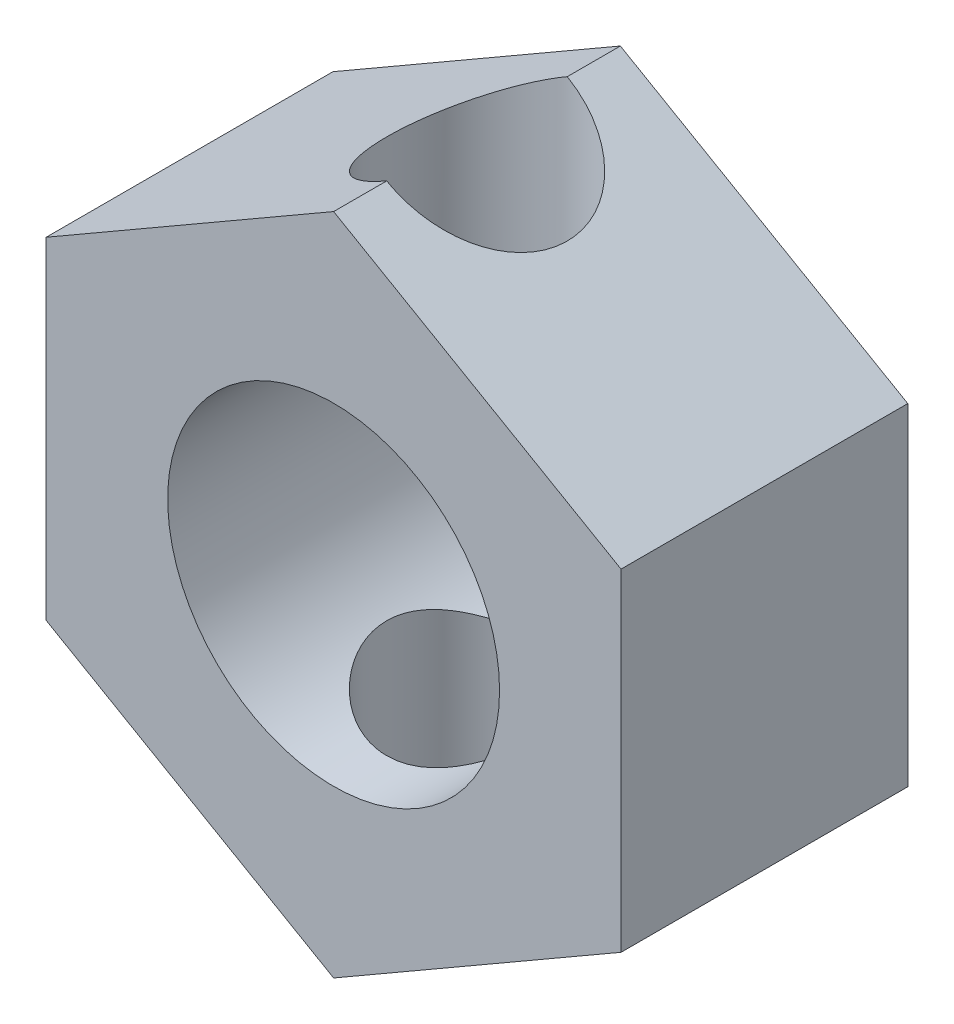
ISO-10303-21;
HEADER;
FILE_DESCRIPTION(('STEP AP214'),'2;1');
FILE_NAME('part.step','',(''),(''),'','','');
FILE_SCHEMA(('AUTOMOTIVE_DESIGN { 1 0 10303 214 1 1 1 1 }'));
ENDSEC;
DATA;
#1=APPLICATION_CONTEXT('core data for automotive mechanical design processes');
#2=APPLICATION_PROTOCOL_DEFINITION('international standard','automotive_design',2000,#1);
#3=PRODUCT_CONTEXT('',#1,'mechanical');
#4=PRODUCT('Part','Part','',(#3));
#5=PRODUCT_RELATED_PRODUCT_CATEGORY('part','',(#4));
#6=PRODUCT_DEFINITION_FORMATION('','',#4);
#7=PRODUCT_DEFINITION_CONTEXT('part definition',#1,'design');
#8=PRODUCT_DEFINITION('design','',#6,#7);
#9=PRODUCT_DEFINITION_SHAPE('','',#8);
#10=(LENGTH_UNIT() NAMED_UNIT(*) SI_UNIT(.MILLI.,.METRE.));
#11=(NAMED_UNIT(*) PLANE_ANGLE_UNIT() SI_UNIT($,.RADIAN.));
#12=(NAMED_UNIT(*) SI_UNIT($,.STERADIAN.) SOLID_ANGLE_UNIT());
#13=UNCERTAINTY_MEASURE_WITH_UNIT(LENGTH_MEASURE(1.E-05),#10,'distance_accuracy_value','');
#14=(GEOMETRIC_REPRESENTATION_CONTEXT(3) GLOBAL_UNCERTAINTY_ASSIGNED_CONTEXT((#13)) GLOBAL_UNIT_ASSIGNED_CONTEXT((#10,
#11,#12)) REPRESENTATION_CONTEXT('',''));
#15=CARTESIAN_POINT('',(0.,0.,0.));
#16=DIRECTION('',(0.,0.,1.));
#17=DIRECTION('',(1.,0.,0.));
#18=AXIS2_PLACEMENT_3D('',#15,#16,#17);
#19=CARTESIAN_POINT('',(0.,6.34981373060133,5.4864));
#20=DIRECTION('',(0.,0.,-1.));
#21=DIRECTION('',(-1.,0.,0.));
#22=AXIS2_PLACEMENT_3D('',#19,#20,#21);
#23=PLANE('',#22);
#24=DIRECTION('',(-0.866025403784438,0.500000000000001,0.));
#25=VECTOR('',#24,1.);
#26=CARTESIAN_POINT('',(0.,6.34981373060133,5.4864));
#27=LINE('',#26,#25);
#28=CARTESIAN_POINT('',(5.4991,3.17490686530066,5.4864));
#29=VERTEX_POINT('',#28);
#30=CARTESIAN_POINT('',(0.,6.34981373060133,5.4864));
#31=VERTEX_POINT('',#30);
#32=EDGE_CURVE('E510',#29,#31,#27,.T.);
#33=ORIENTED_EDGE('',*,*,#32,.T.);
#34=DIRECTION('',(-0.866025403784438,-0.500000000000001,0.));
#35=VECTOR('',#34,1.);
#36=CARTESIAN_POINT('',(0.,6.34981373060133,5.4864));
#37=LINE('',#36,#35);
#38=CARTESIAN_POINT('',(-5.4991,3.17490686530065,5.4864));
#39=VERTEX_POINT('',#38);
#40=EDGE_CURVE('E507',#31,#39,#37,.T.);
#41=ORIENTED_EDGE('',*,*,#40,.T.);
#42=DIRECTION('',(0.,-1.,0.));
#43=VECTOR('',#42,1.);
#44=CARTESIAN_POINT('',(-5.4991,3.17490686530065,5.4864));
#45=LINE('',#44,#43);
#46=CARTESIAN_POINT('',(-5.4991,-3.17490686530065,5.4864));
#47=VERTEX_POINT('',#46);
#48=EDGE_CURVE('E535',#39,#47,#45,.T.);
#49=ORIENTED_EDGE('',*,*,#48,.T.);
#50=DIRECTION('',(0.866025403784438,-0.500000000000001,0.));
#51=VECTOR('',#50,1.);
#52=CARTESIAN_POINT('',(-5.4991,-3.17490686530065,5.4864));
#53=LINE('',#52,#51);
#54=CARTESIAN_POINT('',(0.,-6.34981373060133,5.4864));
#55=VERTEX_POINT('',#54);
#56=EDGE_CURVE('E537',#47,#55,#53,.T.);
#57=ORIENTED_EDGE('',*,*,#56,.T.);
#58=DIRECTION('',(0.866025403784438,0.500000000000001,0.));
#59=VECTOR('',#58,1.);
#60=CARTESIAN_POINT('',(0.,-6.34981373060133,5.4864));
#61=LINE('',#60,#59);
#62=CARTESIAN_POINT('',(5.4991,-3.17490686530066,5.4864));
#63=VERTEX_POINT('',#62);
#64=EDGE_CURVE('E446',#55,#63,#61,.T.);
#65=ORIENTED_EDGE('',*,*,#64,.T.);
#66=DIRECTION('',(0.,1.,0.));
#67=VECTOR('',#66,1.);
#68=CARTESIAN_POINT('',(5.4991,3.17490686530066,5.4864));
#69=LINE('',#68,#67);
#70=EDGE_CURVE('E540',#63,#29,#69,.T.);
#71=ORIENTED_EDGE('',*,*,#70,.T.);
#72=EDGE_LOOP('',(#33,#41,#49,#57,#65,#71));
#73=FACE_BOUND('',#72,.T.);
#74=CARTESIAN_POINT('',(0.,0.,5.4864));
#75=DIRECTION('',(0.,0.,1.));
#76=DIRECTION('',(1.,0.,0.));
#77=AXIS2_PLACEMENT_3D('',#74,#75,#76);
#78=CIRCLE('',#77,3.175);
#79=CARTESIAN_POINT('',(3.175,0.,5.4864));
#80=VERTEX_POINT('',#79);
#81=EDGE_CURVE('E515',#80,#80,#78,.T.);
#82=ORIENTED_EDGE('',*,*,#81,.F.);
#83=EDGE_LOOP('',(#82));
#84=FACE_BOUND('',#83,.T.);
#85=ADVANCED_FACE('F360',(#73,#84),#23,.F.);
#86=CARTESIAN_POINT('',(0.,6.34981373060133,0.));
#87=DIRECTION('',(0.,0.,-1.));
#88=DIRECTION('',(-1.,0.,0.));
#89=AXIS2_PLACEMENT_3D('',#86,#87,#88);
#90=PLANE('',#89);
#91=DIRECTION('',(-0.866025403784438,0.500000000000001,0.));
#92=VECTOR('',#91,1.);
#93=CARTESIAN_POINT('',(0.,6.34981373060133,0.));
#94=LINE('',#93,#92);
#95=CARTESIAN_POINT('',(5.4991,3.17490686530066,0.));
#96=VERTEX_POINT('',#95);
#97=CARTESIAN_POINT('',(0.,6.34981373060133,0.));
#98=VERTEX_POINT('',#97);
#99=EDGE_CURVE('E521',#96,#98,#94,.T.);
#100=ORIENTED_EDGE('',*,*,#99,.F.);
#101=DIRECTION('',(0.,1.,0.));
#102=VECTOR('',#101,1.);
#103=CARTESIAN_POINT('',(5.4991,3.17490686530066,0.));
#104=LINE('',#103,#102);
#105=CARTESIAN_POINT('',(5.4991,-3.17490686530066,0.));
#106=VERTEX_POINT('',#105);
#107=EDGE_CURVE('E531',#106,#96,#104,.T.);
#108=ORIENTED_EDGE('',*,*,#107,.F.);
#109=DIRECTION('',(0.866025403784438,0.500000000000001,0.));
#110=VECTOR('',#109,1.);
#111=CARTESIAN_POINT('',(0.,-6.34981373060133,0.));
#112=LINE('',#111,#110);
#113=CARTESIAN_POINT('',(0.,-6.34981373060133,0.));
#114=VERTEX_POINT('',#113);
#115=EDGE_CURVE('E529',#114,#106,#112,.T.);
#116=ORIENTED_EDGE('',*,*,#115,.F.);
#117=DIRECTION('',(0.866025403784438,-0.500000000000001,0.));
#118=VECTOR('',#117,1.);
#119=CARTESIAN_POINT('',(-5.4991,-3.17490686530065,0.));
#120=LINE('',#119,#118);
#121=CARTESIAN_POINT('',(-5.4991,-3.17490686530065,0.));
#122=VERTEX_POINT('',#121);
#123=EDGE_CURVE('E527',#122,#114,#120,.T.);
#124=ORIENTED_EDGE('',*,*,#123,.F.);
#125=DIRECTION('',(0.,-1.,0.));
#126=VECTOR('',#125,1.);
#127=CARTESIAN_POINT('',(-5.4991,3.17490686530065,0.));
#128=LINE('',#127,#126);
#129=CARTESIAN_POINT('',(-5.4991,3.17490686530065,0.));
#130=VERTEX_POINT('',#129);
#131=EDGE_CURVE('E525',#130,#122,#128,.T.);
#132=ORIENTED_EDGE('',*,*,#131,.F.);
#133=DIRECTION('',(-0.866025403784438,-0.500000000000001,0.));
#134=VECTOR('',#133,1.);
#135=CARTESIAN_POINT('',(0.,6.34981373060133,0.));
#136=LINE('',#135,#134);
#137=EDGE_CURVE('E523',#98,#130,#136,.T.);
#138=ORIENTED_EDGE('',*,*,#137,.F.);
#139=EDGE_LOOP('',(#100,#108,#116,#124,#132,#138));
#140=FACE_BOUND('',#139,.T.);
#141=CARTESIAN_POINT('',(0.,0.,0.));
#142=DIRECTION('',(0.,0.,1.));
#143=DIRECTION('',(1.,0.,0.));
#144=AXIS2_PLACEMENT_3D('',#141,#142,#143);
#145=CIRCLE('',#144,3.175);
#146=CARTESIAN_POINT('',(3.175,0.,0.));
#147=VERTEX_POINT('',#146);
#148=EDGE_CURVE('E512',#147,#147,#145,.T.);
#149=ORIENTED_EDGE('',*,*,#148,.T.);
#150=EDGE_LOOP('',(#149));
#151=FACE_BOUND('',#150,.T.);
#152=ADVANCED_FACE('F477',(#140,#151),#90,.T.);
#153=CARTESIAN_POINT('',(0.,6.34981373060133,5.4864));
#154=DIRECTION('',(-0.500000000000001,-0.866025403784438,0.));
#155=DIRECTION('',(0.866025403784438,-0.500000000000001,0.));
#156=AXIS2_PLACEMENT_3D('',#153,#154,#155);
#157=PLANE('',#156);
#158=DIRECTION('',(0.,0.,-1.));
#159=VECTOR('',#158,1.);
#160=CARTESIAN_POINT('',(0.,6.34981373060133,5.4864));
#161=LINE('',#160,#159);
#162=CARTESIAN_POINT('',(0.,6.34981373060133,1.016));
#163=VERTEX_POINT('',#162);
#164=EDGE_CURVE('E373',#163,#98,#161,.T.);
#165=ORIENTED_EDGE('',*,*,#164,.F.);
#166=CARTESIAN_POINT('',(0.,6.34981373060133,2.7432));
#167=DIRECTION('',(-0.500000000000001,-0.866025403784438,0.));
#168=DIRECTION('',(-0.866025403784438,0.500000000000001,0.));
#169=AXIS2_PLACEMENT_3D('',#166,#167,#168);
#170=ELLIPSE('',#169,1.99439876988864,1.7272);
#171=CARTESIAN_POINT('',(0.,6.34981373060133,4.4704));
#172=VERTEX_POINT('',#171);
#173=EDGE_CURVE('E380',#163,#172,#170,.T.);
#174=ORIENTED_EDGE('',*,*,#173,.T.);
#175=EDGE_CURVE('E11',#31,#172,#161,.T.);
#176=ORIENTED_EDGE('',*,*,#175,.F.);
#177=ORIENTED_EDGE('',*,*,#32,.F.);
#178=DIRECTION('',(0.,0.,-1.));
#179=VECTOR('',#178,1.);
#180=CARTESIAN_POINT('',(5.4991,3.17490686530066,5.4864));
#181=LINE('',#180,#179);
#182=EDGE_CURVE('E541',#29,#96,#181,.T.);
#183=ORIENTED_EDGE('',*,*,#182,.T.);
#184=ORIENTED_EDGE('',*,*,#99,.T.);
#185=EDGE_LOOP('',(#165,#174,#176,#177,#183,#184));
#186=FACE_BOUND('',#185,.T.);
#187=ADVANCED_FACE('F362',(#186),#157,.F.);
#188=CARTESIAN_POINT('',(0.,6.34981373060133,5.4864));
#189=DIRECTION('',(0.500000000000001,-0.866025403784438,0.));
#190=DIRECTION('',(0.866025403784438,0.500000000000001,0.));
#191=AXIS2_PLACEMENT_3D('',#188,#189,#190);
#192=PLANE('',#191);
#193=ORIENTED_EDGE('',*,*,#175,.T.);
#194=CARTESIAN_POINT('',(0.,6.34981373060133,2.7432));
#195=DIRECTION('',(0.500000000000001,-0.866025403784438,0.));
#196=DIRECTION('',(0.866025403784438,0.500000000000001,0.));
#197=AXIS2_PLACEMENT_3D('',#194,#195,#196);
#198=ELLIPSE('',#197,1.99439876988865,1.7272);
#199=EDGE_CURVE('E442',#172,#163,#198,.T.);
#200=ORIENTED_EDGE('',*,*,#199,.T.);
#201=ORIENTED_EDGE('',*,*,#164,.T.);
#202=ORIENTED_EDGE('',*,*,#137,.T.);
#203=DIRECTION('',(0.,0.,-1.));
#204=VECTOR('',#203,1.);
#205=CARTESIAN_POINT('',(-5.4991,3.17490686530065,5.4864));
#206=LINE('',#205,#204);
#207=EDGE_CURVE('E450',#39,#130,#206,.T.);
#208=ORIENTED_EDGE('',*,*,#207,.F.);
#209=ORIENTED_EDGE('',*,*,#40,.F.);
#210=EDGE_LOOP('',(#193,#200,#201,#202,#208,#209));
#211=FACE_BOUND('',#210,.T.);
#212=ADVANCED_FACE('F496',(#211),#192,.F.);
#213=CARTESIAN_POINT('',(-5.4991,3.17490686530065,5.4864));
#214=DIRECTION('',(1.,0.,0.));
#215=DIRECTION('',(0.,0.,-1.));
#216=AXIS2_PLACEMENT_3D('',#213,#214,#215);
#217=PLANE('',#216);
#218=ORIENTED_EDGE('',*,*,#131,.T.);
#219=DIRECTION('',(0.,0.,-1.));
#220=VECTOR('',#219,1.);
#221=CARTESIAN_POINT('',(-5.4991,-3.17490686530065,5.4864));
#222=LINE('',#221,#220);
#223=EDGE_CURVE('E447',#47,#122,#222,.T.);
#224=ORIENTED_EDGE('',*,*,#223,.F.);
#225=ORIENTED_EDGE('',*,*,#48,.F.);
#226=ORIENTED_EDGE('',*,*,#207,.T.);
#227=EDGE_LOOP('',(#218,#224,#225,#226));
#228=FACE_BOUND('',#227,.T.);
#229=ADVANCED_FACE('F494',(#228),#217,.F.);
#230=CARTESIAN_POINT('',(-5.4991,-3.17490686530065,5.4864));
#231=DIRECTION('',(0.500000000000001,0.866025403784438,0.));
#232=DIRECTION('',(-0.866025403784438,0.500000000000001,0.));
#233=AXIS2_PLACEMENT_3D('',#230,#231,#232);
#234=PLANE('',#233);
#235=DIRECTION('',(0.,0.,-1.));
#236=VECTOR('',#235,1.);
#237=CARTESIAN_POINT('',(0.,-6.34981373060133,5.4864));
#238=LINE('',#237,#236);
#239=CARTESIAN_POINT('',(0.,-6.34981373060133,1.016));
#240=VERTEX_POINT('',#239);
#241=EDGE_CURVE('E441',#240,#114,#238,.T.);
#242=ORIENTED_EDGE('',*,*,#241,.F.);
#243=CARTESIAN_POINT('',(0.,-6.34981373060133,2.7432));
#244=DIRECTION('',(0.500000000000001,0.866025403784438,0.));
#245=DIRECTION('',(-0.866025403784438,0.500000000000001,0.));
#246=AXIS2_PLACEMENT_3D('',#243,#244,#245);
#247=ELLIPSE('',#246,1.99439876988865,1.7272);
#248=CARTESIAN_POINT('',(0.,-6.34981373060133,4.4704));
#249=VERTEX_POINT('',#248);
#250=EDGE_CURVE('E387',#240,#249,#247,.T.);
#251=ORIENTED_EDGE('',*,*,#250,.T.);
#252=EDGE_CURVE('E438',#55,#249,#238,.T.);
#253=ORIENTED_EDGE('',*,*,#252,.F.);
#254=ORIENTED_EDGE('',*,*,#56,.F.);
#255=ORIENTED_EDGE('',*,*,#223,.T.);
#256=ORIENTED_EDGE('',*,*,#123,.T.);
#257=EDGE_LOOP('',(#242,#251,#253,#254,#255,#256));
#258=FACE_BOUND('',#257,.T.);
#259=ADVANCED_FACE('F436',(#258),#234,.F.);
#260=CARTESIAN_POINT('',(0.,-6.34981373060133,5.4864));
#261=DIRECTION('',(-0.500000000000001,0.866025403784438,0.));
#262=DIRECTION('',(-0.866025403784438,-0.500000000000001,0.));
#263=AXIS2_PLACEMENT_3D('',#260,#261,#262);
#264=PLANE('',#263);
#265=ORIENTED_EDGE('',*,*,#252,.T.);
#266=CARTESIAN_POINT('',(0.,-6.34981373060133,2.7432));
#267=DIRECTION('',(-0.500000000000001,0.866025403784438,0.));
#268=DIRECTION('',(0.866025403784438,0.500000000000001,0.));
#269=AXIS2_PLACEMENT_3D('',#266,#267,#268);
#270=ELLIPSE('',#269,1.99439876988864,1.7272);
#271=EDGE_CURVE('E428',#249,#240,#270,.T.);
#272=ORIENTED_EDGE('',*,*,#271,.T.);
#273=ORIENTED_EDGE('',*,*,#241,.T.);
#274=ORIENTED_EDGE('',*,*,#115,.T.);
#275=DIRECTION('',(0.,0.,-1.));
#276=VECTOR('',#275,1.);
#277=CARTESIAN_POINT('',(5.4991,-3.17490686530066,5.4864));
#278=LINE('',#277,#276);
#279=EDGE_CURVE('E452',#63,#106,#278,.T.);
#280=ORIENTED_EDGE('',*,*,#279,.F.);
#281=ORIENTED_EDGE('',*,*,#64,.F.);
#282=EDGE_LOOP('',(#265,#272,#273,#274,#280,#281));
#283=FACE_BOUND('',#282,.T.);
#284=ADVANCED_FACE('F444',(#283),#264,.F.);
#285=CARTESIAN_POINT('',(5.4991,3.17490686530066,5.4864));
#286=DIRECTION('',(-1.,0.,0.));
#287=DIRECTION('',(0.,0.,1.));
#288=AXIS2_PLACEMENT_3D('',#285,#286,#287);
#289=PLANE('',#288);
#290=ORIENTED_EDGE('',*,*,#107,.T.);
#291=ORIENTED_EDGE('',*,*,#182,.F.);
#292=ORIENTED_EDGE('',*,*,#70,.F.);
#293=ORIENTED_EDGE('',*,*,#279,.T.);
#294=EDGE_LOOP('',(#290,#291,#292,#293));
#295=FACE_BOUND('',#294,.T.);
#296=ADVANCED_FACE('F474',(#295),#289,.F.);
#297=CARTESIAN_POINT('',(0.,0.,5.4864));
#298=DIRECTION('',(0.,0.,-1.));
#299=DIRECTION('',(-1.,0.,0.));
#300=AXIS2_PLACEMENT_3D('',#297,#298,#299);
#301=CYLINDRICAL_SURFACE('',#300,3.175);
#302=CARTESIAN_POINT('',(0.,-3.175,4.4704));
#303=CARTESIAN_POINT('',(0.0898167329870319,-3.17499484200097,4.47039426316033));
#304=CARTESIAN_POINT('',(0.179710396777628,-3.17114975925812,4.46335353824676));
#305=CARTESIAN_POINT('',(0.356779036000196,-3.15614659634562,4.43553214119056));
#306=CARTESIAN_POINT('',(0.443949931988856,-3.14497804708023,4.41473179892229));
#307=CARTESIAN_POINT('',(0.612755080544286,-3.11648141632095,4.36047558287019));
#308=CARTESIAN_POINT('',(0.694410411602408,-3.09917857401842,4.32707153065061));
#309=CARTESIAN_POINT('',(0.850799732084929,-3.05994681948074,4.24885998275857));
#310=CARTESIAN_POINT('',(0.925533518541815,-3.03801777164842,4.20405215282581));
#311=CARTESIAN_POINT('',(1.0716578715755,-2.98973072895781,4.10088302184072));
#312=CARTESIAN_POINT('',(1.14247785066843,-2.96317321502845,4.04180856025901));
#313=CARTESIAN_POINT('',(1.27374384775618,-2.90916641429737,3.91334660815034));
#314=CARTESIAN_POINT('',(1.33418038986057,-2.88171633982664,3.84394980409459));
#315=CARTESIAN_POINT('',(1.44881148181351,-2.82595304844433,3.68888927626324));
#316=CARTESIAN_POINT('',(1.5018524704536,-2.79780929477208,3.60230392840672));
#317=CARTESIAN_POINT('',(1.59241122402044,-2.7472815216645,3.41980814769005));
#318=CARTESIAN_POINT('',(1.62994117568031,-2.72489298571024,3.32390510902082));
#319=CARTESIAN_POINT('',(1.68576600124417,-2.69069454210209,3.13151974847052));
#320=CARTESIAN_POINT('',(1.70512359412162,-2.67830711291766,3.03545444315249));
#321=CARTESIAN_POINT('',(1.72721683304719,-2.66412109265389,2.84071296602228));
#322=CARTESIAN_POINT('',(1.72997524162547,-2.66230800104692,2.74204055605041));
#323=CARTESIAN_POINT('',(1.71956662107674,-2.66903051227905,2.56066642573841));
#324=CARTESIAN_POINT('',(1.7086960464526,-2.67607428080865,2.47776228487492));
#325=CARTESIAN_POINT('',(1.67539045912867,-2.69704944144968,2.31521296463369));
#326=CARTESIAN_POINT('',(1.65295041225415,-2.71098383173981,2.2355692202353));
#327=CARTESIAN_POINT('',(1.59682922869678,-2.74442012851359,2.07958562434921));
#328=CARTESIAN_POINT('',(1.56291239932,-2.76403741356199,2.00335650840409));
#329=CARTESIAN_POINT('',(1.48500048339766,-2.80666515066853,1.85728015534768));
#330=CARTESIAN_POINT('',(1.44100099769845,-2.82967708227558,1.78743572259403));
#331=CARTESIAN_POINT('',(1.33631133979448,-2.88076103596006,1.64480391669395));
#332=CARTESIAN_POINT('',(1.27409486773378,-2.90906693011305,1.57321637617155));
#333=CARTESIAN_POINT('',(1.13855614581348,-2.96474061704806,1.44093880325029));
#334=CARTESIAN_POINT('',(1.06522665805137,-2.99210778408684,1.38025592977166));
#335=CARTESIAN_POINT('',(0.903660215249716,-3.04494539658694,1.26776420536643));
#336=CARTESIAN_POINT('',(0.814767962766248,-3.07018080541161,1.21677662560585));
#337=CARTESIAN_POINT('',(0.627961499064385,-3.11375255101697,1.13092760937982));
#338=CARTESIAN_POINT('',(0.530055717587379,-3.13209525409142,1.09605128524923));
#339=CARTESIAN_POINT('',(0.337632448212788,-3.15835019333608,1.04668486278066));
#340=CARTESIAN_POINT('',(0.243631771803311,-3.16706671226616,1.03061455863196));
#341=CARTESIAN_POINT('',(0.0538862781183495,-3.17595961869238,1.01422149624866));
#342=CARTESIAN_POINT('',(-0.0418574275379516,-3.17614127075226,1.01388903043898));
#343=CARTESIAN_POINT('',(-0.222630300123887,-3.16835426762471,1.02823965118669));
#344=CARTESIAN_POINT('',(-0.307811973389664,-3.16115964711464,1.04149669083814));
#345=CARTESIAN_POINT('',(-0.474526421749048,-3.14046289285925,1.08025979224462));
#346=CARTESIAN_POINT('',(-0.556058823079064,-3.12696011463607,1.10576710556589));
#347=CARTESIAN_POINT('',(-0.715436921893435,-3.09443863657224,1.16875149841363));
#348=CARTESIAN_POINT('',(-0.793151670088338,-3.07529823396287,1.20649475616212));
#349=CARTESIAN_POINT('',(-0.941355668884583,-3.03321912282633,1.29253789832276));
#350=CARTESIAN_POINT('',(-1.01184219665667,-3.01027899141093,1.3408417395432));
#351=CARTESIAN_POINT('',(-1.15187925533852,-2.95971846730473,1.45273874061451));
#352=CARTESIAN_POINT('',(-1.22046654048612,-2.93186099072405,1.51743133330519));
#353=CARTESIAN_POINT('',(-1.34632605581709,-2.87624333035612,1.65716090069406));
#354=CARTESIAN_POINT('',(-1.40358695617026,-2.84848327100078,1.73220810708041));
#355=CARTESIAN_POINT('',(-1.50930406073951,-2.79399702964103,1.89731456803237));
#356=CARTESIAN_POINT('',(-1.55679695839788,-2.7674988325876,1.98807334753819));
#357=CARTESIAN_POINT('',(-1.63536975293384,-2.7218154792425,2.17811790282001));
#358=CARTESIAN_POINT('',(-1.66647342303255,-2.70261974175344,2.27739108354074));
#359=CARTESIAN_POINT('',(-1.70828382295167,-2.67636880112584,2.47144719011798));
#360=CARTESIAN_POINT('',(-1.72068332127368,-2.668312524142,2.56572446352123));
#361=CARTESIAN_POINT('',(-1.72975688521704,-2.66244374147667,2.75532206760347));
#362=CARTESIAN_POINT('',(-1.72644337296087,-2.66462314383421,2.85064151491499));
#363=CARTESIAN_POINT('',(-1.70582759803793,-2.67785061366613,3.02632479252249));
#364=CARTESIAN_POINT('',(-1.69041123113614,-2.6877017050996,3.10701438229931));
#365=CARTESIAN_POINT('',(-1.64867033738276,-2.71350503746821,3.26449218816027));
#366=CARTESIAN_POINT('',(-1.62234150227161,-2.72945968790626,3.34127884990558));
#367=CARTESIAN_POINT('',(-1.55774844297325,-2.76686018244403,3.49417018057132));
#368=CARTESIAN_POINT('',(-1.51884069270724,-2.78858706965437,3.56993178768551));
#369=CARTESIAN_POINT('',(-1.43081457938665,-2.83476013423946,3.71435951711862));
#370=CARTESIAN_POINT('',(-1.38169075459496,-2.85920776291876,3.78302181447284));
#371=CARTESIAN_POINT('',(-1.26590027631126,-2.91252000323831,3.92223033835789));
#372=CARTESIAN_POINT('',(-1.19770097359167,-2.94148987707649,3.99146849457056));
#373=CARTESIAN_POINT('',(-1.05011316478987,-2.99735105334147,4.11794712844454));
#374=CARTESIAN_POINT('',(-0.970716985738062,-3.02424091064674,4.17517931121356));
#375=CARTESIAN_POINT('',(-0.799648332324617,-3.07398126546603,4.27748011125118));
#376=CARTESIAN_POINT('',(-0.707672838408708,-3.09668166594536,4.32211931330015));
#377=CARTESIAN_POINT('',(-0.515991222207537,-3.13430112883055,4.39468714665707));
#378=CARTESIAN_POINT('',(-0.416306007716474,-3.14924044322134,4.4226592977591));
#379=CARTESIAN_POINT('',(-0.262876021187144,-3.16452941008055,4.45109225903149));
#380=CARTESIAN_POINT('',(-0.210650818113228,-3.16844092250735,4.45831759952544));
#381=CARTESIAN_POINT('',(-0.105625946387151,-3.17367773046768,4.46797314994273));
#382=CARTESIAN_POINT('',(-0.0528262794477243,-3.17500303370974,4.47040337415852));
#383=CARTESIAN_POINT('',(0.,-3.175,4.4704));
#384=B_SPLINE_CURVE_WITH_KNOTS('',3,(#302,#303,#304,#305,#306,#307,#308,#309,#310,#311,#312,
#313,#314,#315,#316,#317,#318,#319,#320,#321,#322,#323,#324,#325,#326,#327,#328,#329,#330,#331,
#332,#333,#334,#335,#336,#337,#338,#339,#340,#341,#342,#343,#344,#345,#346,#347,#348,#349,#350,
#351,#352,#353,#354,#355,#356,#357,#358,#359,#360,#361,#362,#363,#364,#365,#366,#367,#368,#369,
#370,#371,#372,#373,#374,#375,#376,#377,#378,#379,#380,#381,#382,#383),.UNSPECIFIED.,.T.,.F.,(4,
2,2,2,2,2,2,2,2,2,2,2,2,2,2,2,2,2,2,2,2,2,2,2,2,2,2,2,2,2,2,2,2,2,2,2,2,2,2,2,4),(0.,
0.269237366741943,0.538860457206649,0.807386833520669,1.07592108161609,1.36266948063225,
1.64967819109358,1.96419704531975,2.27846831600627,2.57294341145819,2.86701459980268,
3.11756500584304,3.36822452493014,3.62438021478773,3.88064788119479,4.17633401900357,
4.47221357134702,4.78711425412076,5.10172336681184,5.38739145348506,5.67288332913719,
5.93120440761279,6.18955188343689,6.45394594831553,6.7184392458725,7.01214559552773,
7.30614427141866,7.6218681846216,7.93713285826403,8.22166481147848,8.50597186181727,
8.75310154925956,9.00032889696823,9.26301971807991,9.52585134216132,9.82874467547091,
10.131846592656,10.4442934112149,10.7559207748693,10.9142749065924,11.0726285663201),.UNSPECIFIED.);
#385=CARTESIAN_POINT('',(0.,-3.175,4.4704));
#386=VERTEX_POINT('',#385);
#387=EDGE_CURVE('E364',#386,#386,#384,.T.);
#388=ORIENTED_EDGE('',*,*,#387,.F.);
#389=EDGE_LOOP('',(#388));
#390=FACE_BOUND('',#389,.T.);
#391=CARTESIAN_POINT('',(0.,3.175,4.4704));
#392=CARTESIAN_POINT('',(-0.0898167329870319,3.17499484200097,4.47039426316033));
#393=CARTESIAN_POINT('',(-0.179710396777628,3.17114975925812,4.46335353824676));
#394=CARTESIAN_POINT('',(-0.356779036000196,3.15614659634562,4.43553214119056));
#395=CARTESIAN_POINT('',(-0.443949931988856,3.14497804708023,4.41473179892229));
#396=CARTESIAN_POINT('',(-0.612755080544286,3.11648141632095,4.36047558287019));
#397=CARTESIAN_POINT('',(-0.694410411602408,3.09917857401842,4.32707153065061));
#398=CARTESIAN_POINT('',(-0.850799732084929,3.05994681948074,4.24885998275857));
#399=CARTESIAN_POINT('',(-0.925533518541815,3.03801777164842,4.20405215282581));
#400=CARTESIAN_POINT('',(-1.0716578715755,2.98973072895781,4.10088302184072));
#401=CARTESIAN_POINT('',(-1.14247785066843,2.96317321502845,4.04180856025901));
#402=CARTESIAN_POINT('',(-1.27374384775618,2.90916641429737,3.91334660815034));
#403=CARTESIAN_POINT('',(-1.33418038986057,2.88171633982664,3.84394980409459));
#404=CARTESIAN_POINT('',(-1.44881148181351,2.82595304844433,3.68888927626324));
#405=CARTESIAN_POINT('',(-1.5018524704536,2.79780929477208,3.60230392840672));
#406=CARTESIAN_POINT('',(-1.59241122402044,2.7472815216645,3.41980814769005));
#407=CARTESIAN_POINT('',(-1.62994117568031,2.72489298571024,3.32390510902082));
#408=CARTESIAN_POINT('',(-1.68576600124417,2.69069454210209,3.13151974847052));
#409=CARTESIAN_POINT('',(-1.70512359412162,2.67830711291766,3.03545444315249));
#410=CARTESIAN_POINT('',(-1.72721683304719,2.66412109265389,2.84071296602228));
#411=CARTESIAN_POINT('',(-1.72997524162547,2.66230800104692,2.74204055605041));
#412=CARTESIAN_POINT('',(-1.71956662107674,2.66903051227905,2.56066642573841));
#413=CARTESIAN_POINT('',(-1.7086960464526,2.67607428080865,2.47776228487492));
#414=CARTESIAN_POINT('',(-1.67539045912867,2.69704944144968,2.31521296463369));
#415=CARTESIAN_POINT('',(-1.65295041225415,2.71098383173981,2.2355692202353));
#416=CARTESIAN_POINT('',(-1.59682922869678,2.74442012851359,2.07958562434921));
#417=CARTESIAN_POINT('',(-1.56291239932,2.76403741356199,2.00335650840409));
#418=CARTESIAN_POINT('',(-1.48500048339766,2.80666515066853,1.85728015534768));
#419=CARTESIAN_POINT('',(-1.44100099769845,2.82967708227558,1.78743572259403));
#420=CARTESIAN_POINT('',(-1.33631133979448,2.88076103596006,1.64480391669395));
#421=CARTESIAN_POINT('',(-1.27409486773378,2.90906693011305,1.57321637617155));
#422=CARTESIAN_POINT('',(-1.13855614581348,2.96474061704806,1.44093880325029));
#423=CARTESIAN_POINT('',(-1.06522665805137,2.99210778408684,1.38025592977166));
#424=CARTESIAN_POINT('',(-0.903660215249716,3.04494539658694,1.26776420536643));
#425=CARTESIAN_POINT('',(-0.814767962766248,3.07018080541161,1.21677662560585));
#426=CARTESIAN_POINT('',(-0.627961499064385,3.11375255101697,1.13092760937982));
#427=CARTESIAN_POINT('',(-0.530055717587379,3.13209525409142,1.09605128524923));
#428=CARTESIAN_POINT('',(-0.337632448212788,3.15835019333608,1.04668486278066));
#429=CARTESIAN_POINT('',(-0.243631771803311,3.16706671226616,1.03061455863196));
#430=CARTESIAN_POINT('',(-0.0538862781183495,3.17595961869238,1.01422149624866));
#431=CARTESIAN_POINT('',(0.0418574275379516,3.17614127075226,1.01388903043898));
#432=CARTESIAN_POINT('',(0.222630300123887,3.16835426762471,1.02823965118669));
#433=CARTESIAN_POINT('',(0.307811973389664,3.16115964711464,1.04149669083814));
#434=CARTESIAN_POINT('',(0.474526421749048,3.14046289285925,1.08025979224462));
#435=CARTESIAN_POINT('',(0.556058823079064,3.12696011463607,1.10576710556589));
#436=CARTESIAN_POINT('',(0.715436921893435,3.09443863657224,1.16875149841363));
#437=CARTESIAN_POINT('',(0.793151670088338,3.07529823396287,1.20649475616212));
#438=CARTESIAN_POINT('',(0.941355668884583,3.03321912282633,1.29253789832276));
#439=CARTESIAN_POINT('',(1.01184219665667,3.01027899141093,1.3408417395432));
#440=CARTESIAN_POINT('',(1.15187925533852,2.95971846730473,1.45273874061451));
#441=CARTESIAN_POINT('',(1.22046654048612,2.93186099072405,1.51743133330519));
#442=CARTESIAN_POINT('',(1.34632605581709,2.87624333035612,1.65716090069406));
#443=CARTESIAN_POINT('',(1.40358695617026,2.84848327100078,1.73220810708041));
#444=CARTESIAN_POINT('',(1.50930406073951,2.79399702964103,1.89731456803237));
#445=CARTESIAN_POINT('',(1.55679695839788,2.7674988325876,1.98807334753819));
#446=CARTESIAN_POINT('',(1.63536975293384,2.7218154792425,2.17811790282001));
#447=CARTESIAN_POINT('',(1.66647342303255,2.70261974175344,2.27739108354074));
#448=CARTESIAN_POINT('',(1.70828382295167,2.67636880112584,2.47144719011798));
#449=CARTESIAN_POINT('',(1.72068332127368,2.668312524142,2.56572446352123));
#450=CARTESIAN_POINT('',(1.72975688521704,2.66244374147667,2.75532206760347));
#451=CARTESIAN_POINT('',(1.72644337296087,2.66462314383421,2.85064151491499));
#452=CARTESIAN_POINT('',(1.70582759803793,2.67785061366613,3.02632479252249));
#453=CARTESIAN_POINT('',(1.69041123113614,2.6877017050996,3.10701438229931));
#454=CARTESIAN_POINT('',(1.64867033738276,2.71350503746821,3.26449218816027));
#455=CARTESIAN_POINT('',(1.62234150227161,2.72945968790626,3.34127884990558));
#456=CARTESIAN_POINT('',(1.55774844297325,2.76686018244403,3.49417018057132));
#457=CARTESIAN_POINT('',(1.51884069270724,2.78858706965437,3.56993178768551));
#458=CARTESIAN_POINT('',(1.43081457938665,2.83476013423946,3.71435951711862));
#459=CARTESIAN_POINT('',(1.38169075459496,2.85920776291876,3.78302181447284));
#460=CARTESIAN_POINT('',(1.26590027631126,2.91252000323831,3.92223033835789));
#461=CARTESIAN_POINT('',(1.19770097359167,2.94148987707649,3.99146849457056));
#462=CARTESIAN_POINT('',(1.05011316478987,2.99735105334147,4.11794712844454));
#463=CARTESIAN_POINT('',(0.970716985738062,3.02424091064674,4.17517931121356));
#464=CARTESIAN_POINT('',(0.799648332324617,3.07398126546603,4.27748011125118));
#465=CARTESIAN_POINT('',(0.707672838408708,3.09668166594536,4.32211931330015));
#466=CARTESIAN_POINT('',(0.515991222207537,3.13430112883055,4.39468714665707));
#467=CARTESIAN_POINT('',(0.416306007716474,3.14924044322134,4.4226592977591));
#468=CARTESIAN_POINT('',(0.262876021187144,3.16452941008055,4.45109225903149));
#469=CARTESIAN_POINT('',(0.210650818113228,3.16844092250735,4.45831759952544));
#470=CARTESIAN_POINT('',(0.105625946387151,3.17367773046768,4.46797314994273));
#471=CARTESIAN_POINT('',(0.0528262794477243,3.17500303370974,4.47040337415852));
#472=CARTESIAN_POINT('',(0.,3.175,4.4704));
#473=B_SPLINE_CURVE_WITH_KNOTS('',3,(#391,#392,#393,#394,#395,#396,#397,#398,#399,#400,#401,
#402,#403,#404,#405,#406,#407,#408,#409,#410,#411,#412,#413,#414,#415,#416,#417,#418,#419,#420,
#421,#422,#423,#424,#425,#426,#427,#428,#429,#430,#431,#432,#433,#434,#435,#436,#437,#438,#439,
#440,#441,#442,#443,#444,#445,#446,#447,#448,#449,#450,#451,#452,#453,#454,#455,#456,#457,#458,
#459,#460,#461,#462,#463,#464,#465,#466,#467,#468,#469,#470,#471,#472),.UNSPECIFIED.,.T.,.F.,(4,
2,2,2,2,2,2,2,2,2,2,2,2,2,2,2,2,2,2,2,2,2,2,2,2,2,2,2,2,2,2,2,2,2,2,2,2,2,2,2,4),(0.,
0.269237366741943,0.538860457206649,0.807386833520669,1.07592108161609,1.36266948063225,
1.64967819109358,1.96419704531975,2.27846831600627,2.57294341145819,2.86701459980268,
3.11756500584304,3.36822452493014,3.62438021478773,3.88064788119479,4.17633401900357,
4.47221357134702,4.78711425412076,5.10172336681184,5.38739145348506,5.67288332913719,
5.93120440761279,6.18955188343689,6.45394594831553,6.7184392458725,7.01214559552773,
7.30614427141866,7.6218681846216,7.93713285826403,8.22166481147848,8.50597186181727,
8.75310154925956,9.00032889696823,9.26301971807991,9.52585134216132,9.82874467547091,
10.131846592656,10.4442934112149,10.7559207748693,10.9142749065924,11.0726285663201),.UNSPECIFIED.);
#474=CARTESIAN_POINT('',(0.,3.175,4.4704));
#475=VERTEX_POINT('',#474);
#476=EDGE_CURVE('E457',#475,#475,#473,.T.);
#477=ORIENTED_EDGE('',*,*,#476,.F.);
#478=EDGE_LOOP('',(#477));
#479=FACE_BOUND('',#478,.T.);
#480=ORIENTED_EDGE('',*,*,#81,.T.);
#481=EDGE_LOOP('',(#480));
#482=FACE_BOUND('',#481,.T.);
#483=ORIENTED_EDGE('',*,*,#148,.F.);
#484=EDGE_LOOP('',(#483));
#485=FACE_BOUND('',#484,.T.);
#486=ADVANCED_FACE('F461',(#390,#479,#482,#485),#301,.F.);
#487=CARTESIAN_POINT('',(0.,-6.34981373060133,2.7432));
#488=DIRECTION('',(0.,1.,0.));
#489=DIRECTION('',(0.,0.,1.));
#490=AXIS2_PLACEMENT_3D('',#487,#488,#489);
#491=CYLINDRICAL_SURFACE('',#490,1.7272);
#492=ORIENTED_EDGE('',*,*,#476,.T.);
#493=EDGE_LOOP('',(#492));
#494=FACE_BOUND('',#493,.T.);
#495=ORIENTED_EDGE('',*,*,#199,.F.);
#496=ORIENTED_EDGE('',*,*,#173,.F.);
#497=EDGE_LOOP('',(#495,#496));
#498=FACE_BOUND('',#497,.T.);
#499=ADVANCED_FACE('F464',(#494,#498),#491,.F.);
#500=ORIENTED_EDGE('',*,*,#387,.T.);
#501=EDGE_LOOP('',(#500));
#502=FACE_BOUND('',#501,.T.);
#503=ORIENTED_EDGE('',*,*,#271,.F.);
#504=ORIENTED_EDGE('',*,*,#250,.F.);
#505=EDGE_LOOP('',(#503,#504));
#506=FACE_BOUND('',#505,.T.);
#507=ADVANCED_FACE('F429',(#502,#506),#491,.F.);
#508=CLOSED_SHELL('',(#85,#152,#187,#212,#229,#259,#284,#296,#486,#499,#507));
#509=MANIFOLD_SOLID_BREP('B2',#508);
#510=ADVANCED_BREP_SHAPE_REPRESENTATION('',(#18,#509),#14);
#511=SHAPE_DEFINITION_REPRESENTATION(#9,#510);
ENDSEC;
END-ISO-10303-21;
